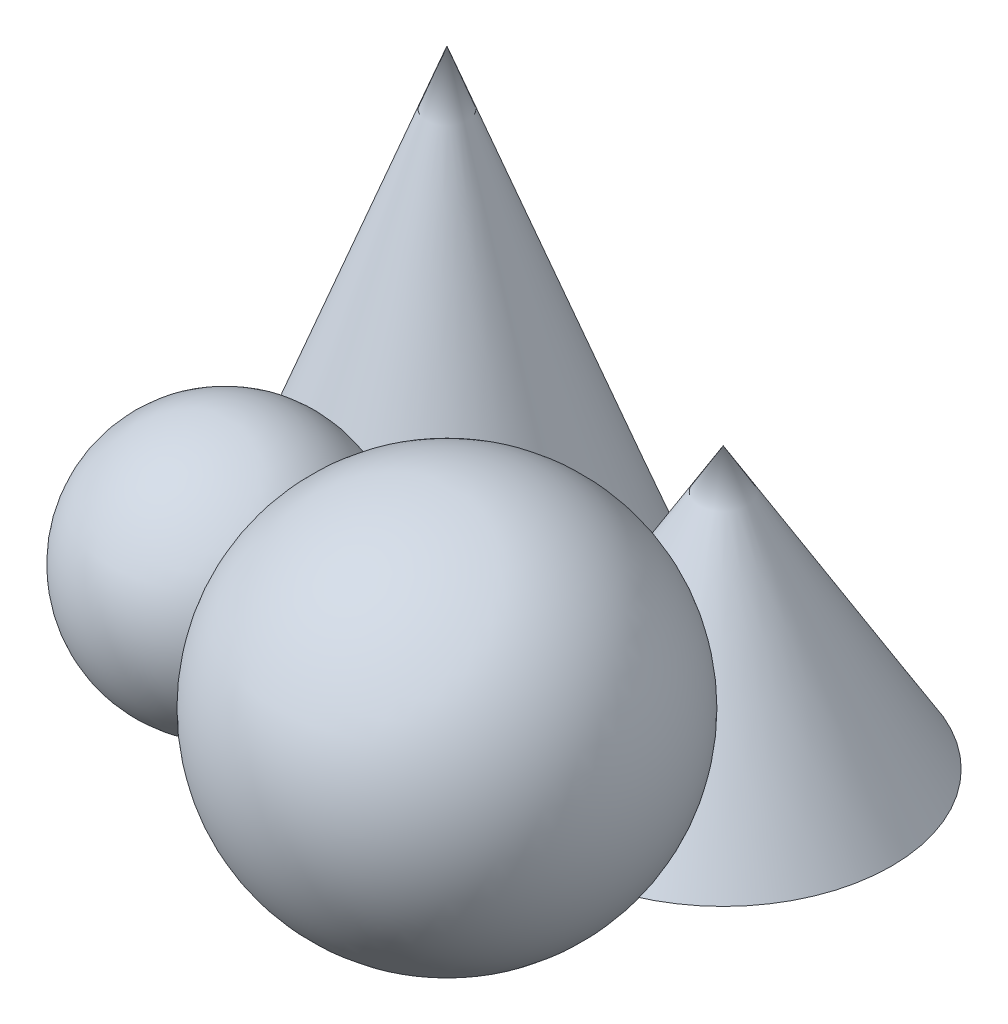
ISO-10303-21;
HEADER;
FILE_DESCRIPTION(('STEP AP214'),'2;1');
FILE_NAME('part.step','',(''),(''),'','','');
FILE_SCHEMA(('AUTOMOTIVE_DESIGN { 1 0 10303 214 1 1 1 1 }'));
ENDSEC;
DATA;
#1=APPLICATION_CONTEXT('core data for automotive mechanical design processes');
#2=APPLICATION_PROTOCOL_DEFINITION('international standard','automotive_design',2000,#1);
#3=PRODUCT_CONTEXT('',#1,'mechanical');
#4=PRODUCT('Part','Part','',(#3));
#5=PRODUCT_RELATED_PRODUCT_CATEGORY('part','',(#4));
#6=PRODUCT_DEFINITION_FORMATION('','',#4);
#7=PRODUCT_DEFINITION_CONTEXT('part definition',#1,'design');
#8=PRODUCT_DEFINITION('design','',#6,#7);
#9=PRODUCT_DEFINITION_SHAPE('','',#8);
#10=(LENGTH_UNIT() NAMED_UNIT(*) SI_UNIT(.MILLI.,.METRE.));
#11=(NAMED_UNIT(*) PLANE_ANGLE_UNIT() SI_UNIT($,.RADIAN.));
#12=(NAMED_UNIT(*) SI_UNIT($,.STERADIAN.) SOLID_ANGLE_UNIT());
#13=UNCERTAINTY_MEASURE_WITH_UNIT(LENGTH_MEASURE(1.E-05),#10,'distance_accuracy_value','');
#14=(GEOMETRIC_REPRESENTATION_CONTEXT(3) GLOBAL_UNCERTAINTY_ASSIGNED_CONTEXT((#13)) GLOBAL_UNIT_ASSIGNED_CONTEXT((#10,
#11,#12)) REPRESENTATION_CONTEXT('',''));
#15=CARTESIAN_POINT('',(0.,0.,0.));
#16=DIRECTION('',(0.,0.,1.));
#17=DIRECTION('',(1.,0.,0.));
#18=AXIS2_PLACEMENT_3D('',#15,#16,#17);
#19=CARTESIAN_POINT('',(5.05797364,23.11687763,45.74120625));
#20=DIRECTION('',(0.,1.,0.));
#21=DIRECTION('',(1.,0.,0.));
#22=AXIS2_PLACEMENT_3D('',#19,#20,#21);
#23=SPHERICAL_SURFACE('',#22,23.11687763);
#24=CARTESIAN_POINT('',(5.05797364,46.23375526,45.74120625));
#25=VERTEX_POINT('',#24);
#26=VERTEX_LOOP('',#25);
#27=FACE_BOUND('',#26,.T.);
#28=ADVANCED_FACE('F39',(#27),#23,.T.);
#29=CLOSED_SHELL('',(#28));
#30=MANIFOLD_SOLID_BREP('B2',#29);
#31=CARTESIAN_POINT('',(60.1040764,0.,9.45621576));
#32=DIRECTION('',(0.,1.,0.));
#33=DIRECTION('',(0.,0.,1.));
#34=AXIS2_PLACEMENT_3D('',#31,#32,#33);
#35=PLANE('',#34);
#36=CARTESIAN_POINT('',(60.1040764,0.,9.45621576));
#37=DIRECTION('',(0.,1.,0.));
#38=DIRECTION('',(0.,0.,1.));
#39=AXIS2_PLACEMENT_3D('',#36,#37,#38);
#40=CIRCLE('',#39,30.84690874);
#41=CARTESIAN_POINT('',(60.1040764,0.,40.3031245));
#42=VERTEX_POINT('',#41);
#43=EDGE_CURVE('E37',#42,#42,#40,.T.);
#44=ORIENTED_EDGE('',*,*,#43,.F.);
#45=EDGE_LOOP('',(#44));
#46=FACE_BOUND('',#45,.T.);
#47=ADVANCED_FACE('F57',(#46),#35,.F.);
#48=CARTESIAN_POINT('',(60.1040764,51.33236066,9.45621576));
#49=DIRECTION('',(0.,-1.,0.));
#50=DIRECTION('',(0.,0.,-1.));
#51=AXIS2_PLACEMENT_3D('',#48,#49,#50);
#52=CONICAL_SURFACE('',#51,0.,0.541099511620228);
#53=ORIENTED_EDGE('',*,*,#43,.T.);
#54=EDGE_LOOP('',(#53));
#55=FACE_BOUND('',#54,.T.);
#56=CARTESIAN_POINT('',(60.1040764,51.33236066,9.45621576));
#57=VERTEX_POINT('',#56);
#58=VERTEX_LOOP('',#57);
#59=FACE_BOUND('',#58,.T.);
#60=ADVANCED_FACE('F67',(#55,#59),#52,.T.);
#61=CLOSED_SHELL('',(#47,#60));
#62=MANIFOLD_SOLID_BREP('B7',#61);
#63=CARTESIAN_POINT('',(60.1040764,35.,60.1040764));
#64=DIRECTION('',(0.,1.,0.));
#65=DIRECTION('',(1.,0.,0.));
#66=AXIS2_PLACEMENT_3D('',#63,#64,#65);
#67=SPHERICAL_SURFACE('',#66,35.);
#68=CARTESIAN_POINT('',(60.1040764,70.,60.1040764));
#69=VERTEX_POINT('',#68);
#70=VERTEX_LOOP('',#69);
#71=FACE_BOUND('',#70,.T.);
#72=ADVANCED_FACE('F115',(#71),#67,.T.);
#73=CLOSED_SHELL('',(#72));
#74=MANIFOLD_SOLID_BREP('B31',#73);
#75=CARTESIAN_POINT('',(0.,0.,0.));
#76=DIRECTION('',(0.,1.,0.));
#77=DIRECTION('',(0.,0.,1.));
#78=AXIS2_PLACEMENT_3D('',#75,#76,#77);
#79=PLANE('',#78);
#80=CARTESIAN_POINT('',(0.,0.,0.));
#81=DIRECTION('',(0.,1.,0.));
#82=DIRECTION('',(0.,0.,1.));
#83=AXIS2_PLACEMENT_3D('',#80,#81,#82);
#84=CIRCLE('',#83,30.);
#85=CARTESIAN_POINT('',(0.,0.,30.));
#86=VERTEX_POINT('',#85);
#87=EDGE_CURVE('E113',#86,#86,#84,.T.);
#88=ORIENTED_EDGE('',*,*,#87,.F.);
#89=EDGE_LOOP('',(#88));
#90=FACE_BOUND('',#89,.T.);
#91=ADVANCED_FACE('F127',(#90),#79,.F.);
#92=CARTESIAN_POINT('',(0.,80.,0.));
#93=DIRECTION('',(0.,-1.,0.));
#94=DIRECTION('',(0.,0.,-1.));
#95=AXIS2_PLACEMENT_3D('',#92,#93,#94);
#96=CONICAL_SURFACE('',#95,0.,0.358770670270572);
#97=ORIENTED_EDGE('',*,*,#87,.T.);
#98=EDGE_LOOP('',(#97));
#99=FACE_BOUND('',#98,.T.);
#100=CARTESIAN_POINT('',(0.,80.,0.));
#101=VERTEX_POINT('',#100);
#102=VERTEX_LOOP('',#101);
#103=FACE_BOUND('',#102,.T.);
#104=ADVANCED_FACE('F137',(#99,#103),#96,.T.);
#105=CLOSED_SHELL('',(#91,#104));
#106=MANIFOLD_SOLID_BREP('B53',#105);
#107=ADVANCED_BREP_SHAPE_REPRESENTATION('',(#18,#30,#62,#74,#106),#14);
#108=SHAPE_DEFINITION_REPRESENTATION(#9,#107);
ENDSEC;
END-ISO-10303-21;
